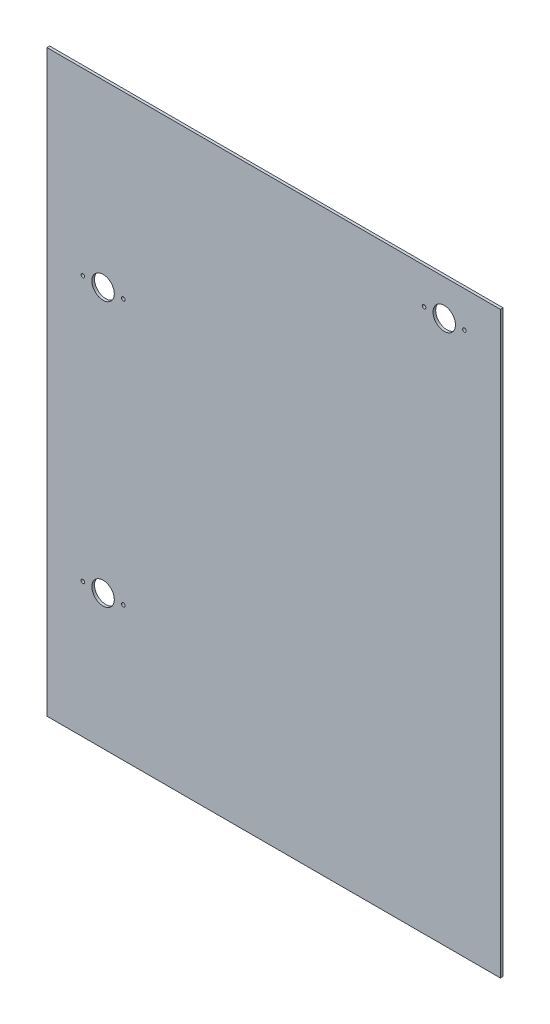
ISO-10303-21;
HEADER;
FILE_DESCRIPTION(('STEP AP214'),'2;1');
FILE_NAME('part.step','',(''),(''),'','','');
FILE_SCHEMA(('AUTOMOTIVE_DESIGN { 1 0 10303 214 1 1 1 1 }'));
ENDSEC;
DATA;
#1=APPLICATION_CONTEXT('core data for automotive mechanical design processes');
#2=APPLICATION_PROTOCOL_DEFINITION('international standard','automotive_design',2000,#1);
#3=PRODUCT_CONTEXT('',#1,'mechanical');
#4=PRODUCT('Part','Part','',(#3));
#5=PRODUCT_RELATED_PRODUCT_CATEGORY('part','',(#4));
#6=PRODUCT_DEFINITION_FORMATION('','',#4);
#7=PRODUCT_DEFINITION_CONTEXT('part definition',#1,'design');
#8=PRODUCT_DEFINITION('design','',#6,#7);
#9=PRODUCT_DEFINITION_SHAPE('','',#8);
#10=(LENGTH_UNIT() NAMED_UNIT(*) SI_UNIT(.MILLI.,.METRE.));
#11=(NAMED_UNIT(*) PLANE_ANGLE_UNIT() SI_UNIT($,.RADIAN.));
#12=(NAMED_UNIT(*) SI_UNIT($,.STERADIAN.) SOLID_ANGLE_UNIT());
#13=UNCERTAINTY_MEASURE_WITH_UNIT(LENGTH_MEASURE(1.E-05),#10,'distance_accuracy_value','');
#14=(GEOMETRIC_REPRESENTATION_CONTEXT(3) GLOBAL_UNCERTAINTY_ASSIGNED_CONTEXT((#13)) GLOBAL_UNIT_ASSIGNED_CONTEXT((#10,
#11,#12)) REPRESENTATION_CONTEXT('',''));
#15=CARTESIAN_POINT('',(0.,0.,0.));
#16=DIRECTION('',(0.,0.,1.));
#17=DIRECTION('',(1.,0.,0.));
#18=AXIS2_PLACEMENT_3D('',#15,#16,#17);
#19=CARTESIAN_POINT('',(0.,0.,3.));
#20=DIRECTION('',(0.,0.,1.));
#21=DIRECTION('',(1.,0.,0.));
#22=AXIS2_PLACEMENT_3D('',#19,#20,#21);
#23=PLANE('',#22);
#24=CARTESIAN_POINT('',(190.,282.5,3.));
#25=DIRECTION('',(0.,0.,1.));
#26=DIRECTION('',(1.,0.,0.));
#27=AXIS2_PLACEMENT_3D('',#24,#25,#26);
#28=CIRCLE('',#27,12.5);
#29=CARTESIAN_POINT('',(202.5,282.5,3.));
#30=VERTEX_POINT('',#29);
#31=EDGE_CURVE('E151',#30,#30,#28,.T.);
#32=ORIENTED_EDGE('',*,*,#31,.F.);
#33=EDGE_LOOP('',(#32));
#34=FACE_BOUND('',#33,.T.);
#35=CARTESIAN_POINT('',(-167.5,122.5,3.));
#36=DIRECTION('',(0.,0.,1.));
#37=DIRECTION('',(1.,0.,0.));
#38=AXIS2_PLACEMENT_3D('',#35,#36,#37);
#39=CIRCLE('',#38,2.);
#40=CARTESIAN_POINT('',(-165.5,122.5,3.));
#41=VERTEX_POINT('',#40);
#42=EDGE_CURVE('E139',#41,#41,#39,.T.);
#43=ORIENTED_EDGE('',*,*,#42,.F.);
#44=EDGE_LOOP('',(#43));
#45=FACE_BOUND('',#44,.T.);
#46=CARTESIAN_POINT('',(-212.5,122.5,3.));
#47=DIRECTION('',(0.,0.,1.));
#48=DIRECTION('',(1.,0.,0.));
#49=AXIS2_PLACEMENT_3D('',#46,#47,#48);
#50=CIRCLE('',#49,2.);
#51=CARTESIAN_POINT('',(-210.5,122.5,3.));
#52=VERTEX_POINT('',#51);
#53=EDGE_CURVE('E127',#52,#52,#50,.T.);
#54=ORIENTED_EDGE('',*,*,#53,.F.);
#55=EDGE_LOOP('',(#54));
#56=FACE_BOUND('',#55,.T.);
#57=CARTESIAN_POINT('',(-190.,-172.5,3.));
#58=DIRECTION('',(0.,0.,1.));
#59=DIRECTION('',(1.,0.,0.));
#60=AXIS2_PLACEMENT_3D('',#57,#58,#59);
#61=CIRCLE('',#60,12.5);
#62=CARTESIAN_POINT('',(-177.5,-172.5,3.));
#63=VERTEX_POINT('',#62);
#64=EDGE_CURVE('E115',#63,#63,#61,.T.);
#65=ORIENTED_EDGE('',*,*,#64,.F.);
#66=EDGE_LOOP('',(#65));
#67=FACE_BOUND('',#66,.T.);
#68=DIRECTION('',(0.,1.,0.));
#69=VECTOR('',#68,1.);
#70=CARTESIAN_POINT('',(252.5,322.5,3.));
#71=LINE('',#70,#69);
#72=CARTESIAN_POINT('',(252.5,-322.5,3.));
#73=VERTEX_POINT('',#72);
#74=CARTESIAN_POINT('',(252.5,322.5,3.));
#75=VERTEX_POINT('',#74);
#76=EDGE_CURVE('E85',#73,#75,#71,.T.);
#77=ORIENTED_EDGE('',*,*,#76,.T.);
#78=DIRECTION('',(-1.,0.,0.));
#79=VECTOR('',#78,1.);
#80=CARTESIAN_POINT('',(-252.5,322.5,3.));
#81=LINE('',#80,#79);
#82=CARTESIAN_POINT('',(-252.5,322.5,3.));
#83=VERTEX_POINT('',#82);
#84=EDGE_CURVE('E80',#75,#83,#81,.T.);
#85=ORIENTED_EDGE('',*,*,#84,.T.);
#86=DIRECTION('',(0.,-1.,0.));
#87=VECTOR('',#86,1.);
#88=CARTESIAN_POINT('',(-252.5,322.5,3.));
#89=LINE('',#88,#87);
#90=CARTESIAN_POINT('',(-252.5,-322.5,3.));
#91=VERTEX_POINT('',#90);
#92=EDGE_CURVE('E83',#83,#91,#89,.T.);
#93=ORIENTED_EDGE('',*,*,#92,.T.);
#94=DIRECTION('',(1.,0.,0.));
#95=VECTOR('',#94,1.);
#96=CARTESIAN_POINT('',(-252.5,-322.5,3.));
#97=LINE('',#96,#95);
#98=EDGE_CURVE('E50',#91,#73,#97,.T.);
#99=ORIENTED_EDGE('',*,*,#98,.T.);
#100=EDGE_LOOP('',(#77,#85,#93,#99));
#101=FACE_BOUND('',#100,.T.);
#102=CARTESIAN_POINT('',(-212.5,-172.5,3.));
#103=DIRECTION('',(0.,0.,1.));
#104=DIRECTION('',(1.,0.,0.));
#105=AXIS2_PLACEMENT_3D('',#102,#103,#104);
#106=CIRCLE('',#105,2.);
#107=CARTESIAN_POINT('',(-210.5,-172.5,3.));
#108=VERTEX_POINT('',#107);
#109=EDGE_CURVE('E100',#108,#108,#106,.T.);
#110=ORIENTED_EDGE('',*,*,#109,.F.);
#111=EDGE_LOOP('',(#110));
#112=FACE_BOUND('',#111,.T.);
#113=CARTESIAN_POINT('',(-167.5,-172.5,3.));
#114=DIRECTION('',(0.,0.,1.));
#115=DIRECTION('',(1.,0.,0.));
#116=AXIS2_PLACEMENT_3D('',#113,#114,#115);
#117=CIRCLE('',#116,2.);
#118=CARTESIAN_POINT('',(-165.5,-172.5,3.));
#119=VERTEX_POINT('',#118);
#120=EDGE_CURVE('E121',#119,#119,#117,.T.);
#121=ORIENTED_EDGE('',*,*,#120,.F.);
#122=EDGE_LOOP('',(#121));
#123=FACE_BOUND('',#122,.T.);
#124=CARTESIAN_POINT('',(-190.,122.5,3.));
#125=DIRECTION('',(0.,0.,1.));
#126=DIRECTION('',(1.,0.,0.));
#127=AXIS2_PLACEMENT_3D('',#124,#125,#126);
#128=CIRCLE('',#127,12.5);
#129=CARTESIAN_POINT('',(-177.5,122.5,3.));
#130=VERTEX_POINT('',#129);
#131=EDGE_CURVE('E133',#130,#130,#128,.T.);
#132=ORIENTED_EDGE('',*,*,#131,.F.);
#133=EDGE_LOOP('',(#132));
#134=FACE_BOUND('',#133,.T.);
#135=CARTESIAN_POINT('',(167.5,282.5,3.));
#136=DIRECTION('',(0.,0.,1.));
#137=DIRECTION('',(1.,0.,0.));
#138=AXIS2_PLACEMENT_3D('',#135,#136,#137);
#139=CIRCLE('',#138,2.);
#140=CARTESIAN_POINT('',(169.5,282.5,3.));
#141=VERTEX_POINT('',#140);
#142=EDGE_CURVE('E145',#141,#141,#139,.T.);
#143=ORIENTED_EDGE('',*,*,#142,.F.);
#144=EDGE_LOOP('',(#143));
#145=FACE_BOUND('',#144,.T.);
#146=CARTESIAN_POINT('',(212.5,282.5,3.));
#147=DIRECTION('',(0.,0.,1.));
#148=DIRECTION('',(1.,0.,0.));
#149=AXIS2_PLACEMENT_3D('',#146,#147,#148);
#150=CIRCLE('',#149,2.);
#151=CARTESIAN_POINT('',(214.5,282.5,3.));
#152=VERTEX_POINT('',#151);
#153=EDGE_CURVE('E157',#152,#152,#150,.T.);
#154=ORIENTED_EDGE('',*,*,#153,.F.);
#155=EDGE_LOOP('',(#154));
#156=FACE_BOUND('',#155,.T.);
#157=ADVANCED_FACE('F33',(#34,#45,#56,#67,#101,#112,#123,#134,#145,#156),#23,.T.);
#158=CARTESIAN_POINT('',(0.,0.,0.));
#159=DIRECTION('',(0.,0.,1.));
#160=DIRECTION('',(1.,0.,0.));
#161=AXIS2_PLACEMENT_3D('',#158,#159,#160);
#162=PLANE('',#161);
#163=DIRECTION('',(0.,1.,0.));
#164=VECTOR('',#163,1.);
#165=CARTESIAN_POINT('',(252.5,322.5,0.));
#166=LINE('',#165,#164);
#167=CARTESIAN_POINT('',(252.5,-322.5,0.));
#168=VERTEX_POINT('',#167);
#169=CARTESIAN_POINT('',(252.5,322.5,0.));
#170=VERTEX_POINT('',#169);
#171=EDGE_CURVE('E97',#168,#170,#166,.T.);
#172=ORIENTED_EDGE('',*,*,#171,.F.);
#173=DIRECTION('',(1.,0.,0.));
#174=VECTOR('',#173,1.);
#175=CARTESIAN_POINT('',(-252.5,-322.5,0.));
#176=LINE('',#175,#174);
#177=CARTESIAN_POINT('',(-252.5,-322.5,0.));
#178=VERTEX_POINT('',#177);
#179=EDGE_CURVE('E73',#178,#168,#176,.T.);
#180=ORIENTED_EDGE('',*,*,#179,.F.);
#181=DIRECTION('',(0.,-1.,0.));
#182=VECTOR('',#181,1.);
#183=CARTESIAN_POINT('',(-252.5,322.5,0.));
#184=LINE('',#183,#182);
#185=CARTESIAN_POINT('',(-252.5,322.5,0.));
#186=VERTEX_POINT('',#185);
#187=EDGE_CURVE('E67',#186,#178,#184,.T.);
#188=ORIENTED_EDGE('',*,*,#187,.F.);
#189=DIRECTION('',(-1.,0.,0.));
#190=VECTOR('',#189,1.);
#191=CARTESIAN_POINT('',(-252.5,322.5,0.));
#192=LINE('',#191,#190);
#193=EDGE_CURVE('E89',#170,#186,#192,.T.);
#194=ORIENTED_EDGE('',*,*,#193,.F.);
#195=EDGE_LOOP('',(#172,#180,#188,#194));
#196=FACE_BOUND('',#195,.T.);
#197=CARTESIAN_POINT('',(-212.5,-172.5,0.));
#198=DIRECTION('',(0.,0.,1.));
#199=DIRECTION('',(1.,0.,0.));
#200=AXIS2_PLACEMENT_3D('',#197,#198,#199);
#201=CIRCLE('',#200,2.);
#202=CARTESIAN_POINT('',(-210.5,-172.5,0.));
#203=VERTEX_POINT('',#202);
#204=EDGE_CURVE('E112',#203,#203,#201,.T.);
#205=ORIENTED_EDGE('',*,*,#204,.T.);
#206=EDGE_LOOP('',(#205));
#207=FACE_BOUND('',#206,.T.);
#208=CARTESIAN_POINT('',(-190.,-172.5,0.));
#209=DIRECTION('',(0.,0.,1.));
#210=DIRECTION('',(1.,0.,0.));
#211=AXIS2_PLACEMENT_3D('',#208,#209,#210);
#212=CIRCLE('',#211,12.5);
#213=CARTESIAN_POINT('',(-177.5,-172.5,0.));
#214=VERTEX_POINT('',#213);
#215=EDGE_CURVE('E118',#214,#214,#212,.T.);
#216=ORIENTED_EDGE('',*,*,#215,.T.);
#217=EDGE_LOOP('',(#216));
#218=FACE_BOUND('',#217,.T.);
#219=CARTESIAN_POINT('',(-167.5,-172.5,0.));
#220=DIRECTION('',(0.,0.,1.));
#221=DIRECTION('',(1.,0.,0.));
#222=AXIS2_PLACEMENT_3D('',#219,#220,#221);
#223=CIRCLE('',#222,2.);
#224=CARTESIAN_POINT('',(-165.5,-172.5,0.));
#225=VERTEX_POINT('',#224);
#226=EDGE_CURVE('E124',#225,#225,#223,.T.);
#227=ORIENTED_EDGE('',*,*,#226,.T.);
#228=EDGE_LOOP('',(#227));
#229=FACE_BOUND('',#228,.T.);
#230=CARTESIAN_POINT('',(-212.5,122.5,0.));
#231=DIRECTION('',(0.,0.,1.));
#232=DIRECTION('',(1.,0.,0.));
#233=AXIS2_PLACEMENT_3D('',#230,#231,#232);
#234=CIRCLE('',#233,2.);
#235=CARTESIAN_POINT('',(-210.5,122.5,0.));
#236=VERTEX_POINT('',#235);
#237=EDGE_CURVE('E130',#236,#236,#234,.T.);
#238=ORIENTED_EDGE('',*,*,#237,.T.);
#239=EDGE_LOOP('',(#238));
#240=FACE_BOUND('',#239,.T.);
#241=CARTESIAN_POINT('',(-190.,122.5,0.));
#242=DIRECTION('',(0.,0.,1.));
#243=DIRECTION('',(1.,0.,0.));
#244=AXIS2_PLACEMENT_3D('',#241,#242,#243);
#245=CIRCLE('',#244,12.5);
#246=CARTESIAN_POINT('',(-177.5,122.5,0.));
#247=VERTEX_POINT('',#246);
#248=EDGE_CURVE('E136',#247,#247,#245,.T.);
#249=ORIENTED_EDGE('',*,*,#248,.T.);
#250=EDGE_LOOP('',(#249));
#251=FACE_BOUND('',#250,.T.);
#252=CARTESIAN_POINT('',(-167.5,122.5,0.));
#253=DIRECTION('',(0.,0.,1.));
#254=DIRECTION('',(1.,0.,0.));
#255=AXIS2_PLACEMENT_3D('',#252,#253,#254);
#256=CIRCLE('',#255,2.);
#257=CARTESIAN_POINT('',(-165.5,122.5,0.));
#258=VERTEX_POINT('',#257);
#259=EDGE_CURVE('E142',#258,#258,#256,.T.);
#260=ORIENTED_EDGE('',*,*,#259,.T.);
#261=EDGE_LOOP('',(#260));
#262=FACE_BOUND('',#261,.T.);
#263=CARTESIAN_POINT('',(167.5,282.5,0.));
#264=DIRECTION('',(0.,0.,1.));
#265=DIRECTION('',(1.,0.,0.));
#266=AXIS2_PLACEMENT_3D('',#263,#264,#265);
#267=CIRCLE('',#266,2.);
#268=CARTESIAN_POINT('',(169.5,282.5,0.));
#269=VERTEX_POINT('',#268);
#270=EDGE_CURVE('E148',#269,#269,#267,.T.);
#271=ORIENTED_EDGE('',*,*,#270,.T.);
#272=EDGE_LOOP('',(#271));
#273=FACE_BOUND('',#272,.T.);
#274=CARTESIAN_POINT('',(190.,282.5,0.));
#275=DIRECTION('',(0.,0.,1.));
#276=DIRECTION('',(1.,0.,0.));
#277=AXIS2_PLACEMENT_3D('',#274,#275,#276);
#278=CIRCLE('',#277,12.5);
#279=CARTESIAN_POINT('',(202.5,282.5,0.));
#280=VERTEX_POINT('',#279);
#281=EDGE_CURVE('E154',#280,#280,#278,.T.);
#282=ORIENTED_EDGE('',*,*,#281,.T.);
#283=EDGE_LOOP('',(#282));
#284=FACE_BOUND('',#283,.T.);
#285=CARTESIAN_POINT('',(212.5,282.5,0.));
#286=DIRECTION('',(0.,0.,1.));
#287=DIRECTION('',(1.,0.,0.));
#288=AXIS2_PLACEMENT_3D('',#285,#286,#287);
#289=CIRCLE('',#288,2.);
#290=CARTESIAN_POINT('',(214.5,282.5,0.));
#291=VERTEX_POINT('',#290);
#292=EDGE_CURVE('E160',#291,#291,#289,.T.);
#293=ORIENTED_EDGE('',*,*,#292,.T.);
#294=EDGE_LOOP('',(#293));
#295=FACE_BOUND('',#294,.T.);
#296=ADVANCED_FACE('F108',(#196,#207,#218,#229,#240,#251,#262,#273,#284,#295),#162,.F.);
#297=CARTESIAN_POINT('',(252.5,322.5,3.));
#298=DIRECTION('',(-1.,0.,0.));
#299=DIRECTION('',(0.,0.,1.));
#300=AXIS2_PLACEMENT_3D('',#297,#298,#299);
#301=PLANE('',#300);
#302=ORIENTED_EDGE('',*,*,#171,.T.);
#303=DIRECTION('',(0.,0.,-1.));
#304=VECTOR('',#303,1.);
#305=CARTESIAN_POINT('',(252.5,322.5,3.));
#306=LINE('',#305,#304);
#307=EDGE_CURVE('E11',#75,#170,#306,.T.);
#308=ORIENTED_EDGE('',*,*,#307,.F.);
#309=ORIENTED_EDGE('',*,*,#76,.F.);
#310=DIRECTION('',(0.,0.,-1.));
#311=VECTOR('',#310,1.);
#312=CARTESIAN_POINT('',(252.5,-322.5,3.));
#313=LINE('',#312,#311);
#314=EDGE_CURVE('E93',#73,#168,#313,.T.);
#315=ORIENTED_EDGE('',*,*,#314,.T.);
#316=EDGE_LOOP('',(#302,#308,#309,#315));
#317=FACE_BOUND('',#316,.T.);
#318=ADVANCED_FACE('F35',(#317),#301,.F.);
#319=CARTESIAN_POINT('',(-252.5,322.5,3.));
#320=DIRECTION('',(0.,-1.,0.));
#321=DIRECTION('',(0.,0.,-1.));
#322=AXIS2_PLACEMENT_3D('',#319,#320,#321);
#323=PLANE('',#322);
#324=ORIENTED_EDGE('',*,*,#193,.T.);
#325=DIRECTION('',(0.,0.,-1.));
#326=VECTOR('',#325,1.);
#327=CARTESIAN_POINT('',(-252.5,322.5,3.));
#328=LINE('',#327,#326);
#329=EDGE_CURVE('E42',#83,#186,#328,.T.);
#330=ORIENTED_EDGE('',*,*,#329,.F.);
#331=ORIENTED_EDGE('',*,*,#84,.F.);
#332=ORIENTED_EDGE('',*,*,#307,.T.);
#333=EDGE_LOOP('',(#324,#330,#331,#332));
#334=FACE_BOUND('',#333,.T.);
#335=ADVANCED_FACE('F88',(#334),#323,.F.);
#336=CARTESIAN_POINT('',(-252.5,322.5,3.));
#337=DIRECTION('',(1.,0.,0.));
#338=DIRECTION('',(0.,1.,0.));
#339=AXIS2_PLACEMENT_3D('',#336,#337,#338);
#340=PLANE('',#339);
#341=ORIENTED_EDGE('',*,*,#187,.T.);
#342=DIRECTION('',(0.,0.,-1.));
#343=VECTOR('',#342,1.);
#344=CARTESIAN_POINT('',(-252.5,-322.5,3.));
#345=LINE('',#344,#343);
#346=EDGE_CURVE('E90',#91,#178,#345,.T.);
#347=ORIENTED_EDGE('',*,*,#346,.F.);
#348=ORIENTED_EDGE('',*,*,#92,.F.);
#349=ORIENTED_EDGE('',*,*,#329,.T.);
#350=EDGE_LOOP('',(#341,#347,#348,#349));
#351=FACE_BOUND('',#350,.T.);
#352=ADVANCED_FACE('F91',(#351),#340,.F.);
#353=CARTESIAN_POINT('',(-252.5,-322.5,3.));
#354=DIRECTION('',(0.,1.,0.));
#355=DIRECTION('',(0.,0.,1.));
#356=AXIS2_PLACEMENT_3D('',#353,#354,#355);
#357=PLANE('',#356);
#358=ORIENTED_EDGE('',*,*,#179,.T.);
#359=ORIENTED_EDGE('',*,*,#314,.F.);
#360=ORIENTED_EDGE('',*,*,#98,.F.);
#361=ORIENTED_EDGE('',*,*,#346,.T.);
#362=EDGE_LOOP('',(#358,#359,#360,#361));
#363=FACE_BOUND('',#362,.T.);
#364=ADVANCED_FACE('F105',(#363),#357,.F.);
#365=CARTESIAN_POINT('',(-212.5,-172.5,3.));
#366=DIRECTION('',(0.,0.,-1.));
#367=DIRECTION('',(-1.,0.,0.));
#368=AXIS2_PLACEMENT_3D('',#365,#366,#367);
#369=CYLINDRICAL_SURFACE('',#368,2.);
#370=ORIENTED_EDGE('',*,*,#109,.T.);
#371=EDGE_LOOP('',(#370));
#372=FACE_BOUND('',#371,.T.);
#373=ORIENTED_EDGE('',*,*,#204,.F.);
#374=EDGE_LOOP('',(#373));
#375=FACE_BOUND('',#374,.T.);
#376=ADVANCED_FACE('F179',(#372,#375),#369,.F.);
#377=CARTESIAN_POINT('',(-190.,-172.5,3.));
#378=DIRECTION('',(0.,0.,-1.));
#379=DIRECTION('',(-1.,0.,0.));
#380=AXIS2_PLACEMENT_3D('',#377,#378,#379);
#381=CYLINDRICAL_SURFACE('',#380,12.5);
#382=ORIENTED_EDGE('',*,*,#64,.T.);
#383=EDGE_LOOP('',(#382));
#384=FACE_BOUND('',#383,.T.);
#385=ORIENTED_EDGE('',*,*,#215,.F.);
#386=EDGE_LOOP('',(#385));
#387=FACE_BOUND('',#386,.T.);
#388=ADVANCED_FACE('F225',(#384,#387),#381,.F.);
#389=CARTESIAN_POINT('',(-167.5,-172.5,3.));
#390=DIRECTION('',(0.,0.,-1.));
#391=DIRECTION('',(-1.,0.,0.));
#392=AXIS2_PLACEMENT_3D('',#389,#390,#391);
#393=CYLINDRICAL_SURFACE('',#392,2.);
#394=ORIENTED_EDGE('',*,*,#120,.T.);
#395=EDGE_LOOP('',(#394));
#396=FACE_BOUND('',#395,.T.);
#397=ORIENTED_EDGE('',*,*,#226,.F.);
#398=EDGE_LOOP('',(#397));
#399=FACE_BOUND('',#398,.T.);
#400=ADVANCED_FACE('F233',(#396,#399),#393,.F.);
#401=CARTESIAN_POINT('',(-212.5,122.5,3.));
#402=DIRECTION('',(0.,0.,-1.));
#403=DIRECTION('',(-1.,0.,0.));
#404=AXIS2_PLACEMENT_3D('',#401,#402,#403);
#405=CYLINDRICAL_SURFACE('',#404,2.);
#406=ORIENTED_EDGE('',*,*,#53,.T.);
#407=EDGE_LOOP('',(#406));
#408=FACE_BOUND('',#407,.T.);
#409=ORIENTED_EDGE('',*,*,#237,.F.);
#410=EDGE_LOOP('',(#409));
#411=FACE_BOUND('',#410,.T.);
#412=ADVANCED_FACE('F241',(#408,#411),#405,.F.);
#413=CARTESIAN_POINT('',(-190.,122.5,3.));
#414=DIRECTION('',(0.,0.,-1.));
#415=DIRECTION('',(-1.,0.,0.));
#416=AXIS2_PLACEMENT_3D('',#413,#414,#415);
#417=CYLINDRICAL_SURFACE('',#416,12.5);
#418=ORIENTED_EDGE('',*,*,#131,.T.);
#419=EDGE_LOOP('',(#418));
#420=FACE_BOUND('',#419,.T.);
#421=ORIENTED_EDGE('',*,*,#248,.F.);
#422=EDGE_LOOP('',(#421));
#423=FACE_BOUND('',#422,.T.);
#424=ADVANCED_FACE('F250',(#420,#423),#417,.F.);
#425=CARTESIAN_POINT('',(-167.5,122.5,3.));
#426=DIRECTION('',(0.,0.,-1.));
#427=DIRECTION('',(-1.,0.,0.));
#428=AXIS2_PLACEMENT_3D('',#425,#426,#427);
#429=CYLINDRICAL_SURFACE('',#428,2.);
#430=ORIENTED_EDGE('',*,*,#42,.T.);
#431=EDGE_LOOP('',(#430));
#432=FACE_BOUND('',#431,.T.);
#433=ORIENTED_EDGE('',*,*,#259,.F.);
#434=EDGE_LOOP('',(#433));
#435=FACE_BOUND('',#434,.T.);
#436=ADVANCED_FACE('F259',(#432,#435),#429,.F.);
#437=CARTESIAN_POINT('',(167.5,282.5,3.));
#438=DIRECTION('',(0.,0.,-1.));
#439=DIRECTION('',(-1.,0.,0.));
#440=AXIS2_PLACEMENT_3D('',#437,#438,#439);
#441=CYLINDRICAL_SURFACE('',#440,2.);
#442=ORIENTED_EDGE('',*,*,#142,.T.);
#443=EDGE_LOOP('',(#442));
#444=FACE_BOUND('',#443,.T.);
#445=ORIENTED_EDGE('',*,*,#270,.F.);
#446=EDGE_LOOP('',(#445));
#447=FACE_BOUND('',#446,.T.);
#448=ADVANCED_FACE('F268',(#444,#447),#441,.F.);
#449=CARTESIAN_POINT('',(190.,282.5,3.));
#450=DIRECTION('',(0.,0.,-1.));
#451=DIRECTION('',(-1.,0.,0.));
#452=AXIS2_PLACEMENT_3D('',#449,#450,#451);
#453=CYLINDRICAL_SURFACE('',#452,12.5);
#454=ORIENTED_EDGE('',*,*,#31,.T.);
#455=EDGE_LOOP('',(#454));
#456=FACE_BOUND('',#455,.T.);
#457=ORIENTED_EDGE('',*,*,#281,.F.);
#458=EDGE_LOOP('',(#457));
#459=FACE_BOUND('',#458,.T.);
#460=ADVANCED_FACE('F277',(#456,#459),#453,.F.);
#461=CARTESIAN_POINT('',(212.5,282.5,3.));
#462=DIRECTION('',(0.,0.,-1.));
#463=DIRECTION('',(-1.,0.,0.));
#464=AXIS2_PLACEMENT_3D('',#461,#462,#463);
#465=CYLINDRICAL_SURFACE('',#464,2.);
#466=ORIENTED_EDGE('',*,*,#153,.T.);
#467=EDGE_LOOP('',(#466));
#468=FACE_BOUND('',#467,.T.);
#469=ORIENTED_EDGE('',*,*,#292,.F.);
#470=EDGE_LOOP('',(#469));
#471=FACE_BOUND('',#470,.T.);
#472=ADVANCED_FACE('F166',(#468,#471),#465,.F.);
#473=CLOSED_SHELL('',(#157,#296,#318,#335,#352,#364,#376,#388,#400,#412,#424,#436,#448,#460,#472));
#474=MANIFOLD_SOLID_BREP('B2',#473);
#475=ADVANCED_BREP_SHAPE_REPRESENTATION('',(#18,#474),#14);
#476=SHAPE_DEFINITION_REPRESENTATION(#9,#475);
ENDSEC;
END-ISO-10303-21;
